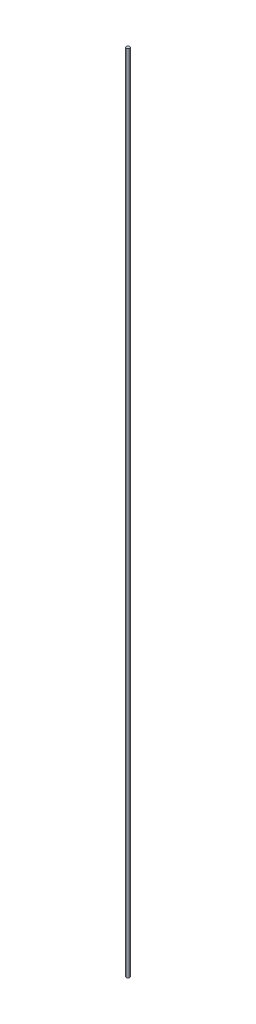
ISO-10303-21;
HEADER;
FILE_DESCRIPTION(('STEP AP214'),'2;1');
FILE_NAME('part.step','',(''),(''),'','','');
FILE_SCHEMA(('AUTOMOTIVE_DESIGN { 1 0 10303 214 1 1 1 1 }'));
ENDSEC;
DATA;
#1=APPLICATION_CONTEXT('core data for automotive mechanical design processes');
#2=APPLICATION_PROTOCOL_DEFINITION('international standard','automotive_design',2000,#1);
#3=PRODUCT_CONTEXT('',#1,'mechanical');
#4=PRODUCT('Part','Part','',(#3));
#5=PRODUCT_RELATED_PRODUCT_CATEGORY('part','',(#4));
#6=PRODUCT_DEFINITION_FORMATION('','',#4);
#7=PRODUCT_DEFINITION_CONTEXT('part definition',#1,'design');
#8=PRODUCT_DEFINITION('design','',#6,#7);
#9=PRODUCT_DEFINITION_SHAPE('','',#8);
#10=(LENGTH_UNIT() NAMED_UNIT(*) SI_UNIT(.MILLI.,.METRE.));
#11=(NAMED_UNIT(*) PLANE_ANGLE_UNIT() SI_UNIT($,.RADIAN.));
#12=(NAMED_UNIT(*) SI_UNIT($,.STERADIAN.) SOLID_ANGLE_UNIT());
#13=UNCERTAINTY_MEASURE_WITH_UNIT(LENGTH_MEASURE(1.E-05),#10,'distance_accuracy_value','');
#14=(GEOMETRIC_REPRESENTATION_CONTEXT(3) GLOBAL_UNCERTAINTY_ASSIGNED_CONTEXT((#13)) GLOBAL_UNIT_ASSIGNED_CONTEXT((#10,
#11,#12)) REPRESENTATION_CONTEXT('',''));
#15=CARTESIAN_POINT('',(0.,0.,0.));
#16=DIRECTION('',(0.,0.,1.));
#17=DIRECTION('',(1.,0.,0.));
#18=AXIS2_PLACEMENT_3D('',#15,#16,#17);
#19=CARTESIAN_POINT('',(0.,1000.,0.));
#20=DIRECTION('',(0.,-1.,0.));
#21=DIRECTION('',(0.,0.,-1.));
#22=AXIS2_PLACEMENT_3D('',#19,#20,#21);
#23=CYLINDRICAL_SURFACE('',#22,2.);
#24=CARTESIAN_POINT('',(0.,1000.,0.));
#25=DIRECTION('',(0.,1.,0.));
#26=DIRECTION('',(0.,0.,1.));
#27=AXIS2_PLACEMENT_3D('',#24,#25,#26);
#28=CIRCLE('',#27,2.);
#29=CARTESIAN_POINT('',(0.,1000.,2.));
#30=VERTEX_POINT('',#29);
#31=EDGE_CURVE('E10',#30,#30,#28,.T.);
#32=ORIENTED_EDGE('',*,*,#31,.F.);
#33=EDGE_LOOP('',(#32));
#34=FACE_BOUND('',#33,.T.);
#35=CARTESIAN_POINT('',(0.,0.,0.));
#36=DIRECTION('',(0.,1.,0.));
#37=DIRECTION('',(0.,0.,1.));
#38=AXIS2_PLACEMENT_3D('',#35,#36,#37);
#39=CIRCLE('',#38,2.);
#40=CARTESIAN_POINT('',(0.,0.,2.));
#41=VERTEX_POINT('',#40);
#42=EDGE_CURVE('E42',#41,#41,#39,.T.);
#43=ORIENTED_EDGE('',*,*,#42,.T.);
#44=EDGE_LOOP('',(#43));
#45=FACE_BOUND('',#44,.T.);
#46=ADVANCED_FACE('F39',(#34,#45),#23,.T.);
#47=CARTESIAN_POINT('',(0.,1000.,0.));
#48=DIRECTION('',(0.,1.,0.));
#49=DIRECTION('',(0.,0.,1.));
#50=AXIS2_PLACEMENT_3D('',#47,#48,#49);
#51=PLANE('',#50);
#52=ORIENTED_EDGE('',*,*,#31,.T.);
#53=EDGE_LOOP('',(#52));
#54=FACE_BOUND('',#53,.T.);
#55=ADVANCED_FACE('F56',(#54),#51,.T.);
#56=CARTESIAN_POINT('',(0.,0.,0.));
#57=DIRECTION('',(0.,1.,0.));
#58=DIRECTION('',(0.,0.,1.));
#59=AXIS2_PLACEMENT_3D('',#56,#57,#58);
#60=PLANE('',#59);
#61=ORIENTED_EDGE('',*,*,#42,.F.);
#62=EDGE_LOOP('',(#61));
#63=FACE_BOUND('',#62,.T.);
#64=ADVANCED_FACE('F54',(#63),#60,.F.);
#65=CLOSED_SHELL('',(#46,#55,#64));
#66=MANIFOLD_SOLID_BREP('B2',#65);
#67=ADVANCED_BREP_SHAPE_REPRESENTATION('',(#18,#66),#14);
#68=SHAPE_DEFINITION_REPRESENTATION(#9,#67);
ENDSEC;
END-ISO-10303-21;
